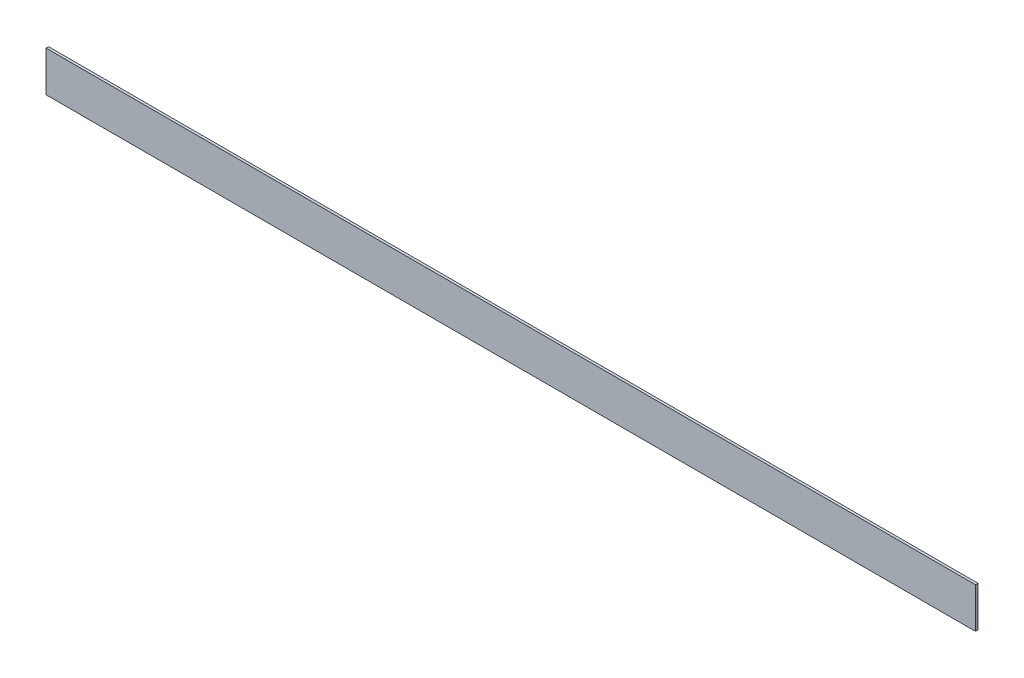
ISO-10303-21;
HEADER;
FILE_DESCRIPTION(('STEP AP214'),'2;1');
FILE_NAME('part.step','',(''),(''),'','','');
FILE_SCHEMA(('AUTOMOTIVE_DESIGN { 1 0 10303 214 1 1 1 1 }'));
ENDSEC;
DATA;
#1=APPLICATION_CONTEXT('core data for automotive mechanical design processes');
#2=APPLICATION_PROTOCOL_DEFINITION('international standard','automotive_design',2000,#1);
#3=PRODUCT_CONTEXT('',#1,'mechanical');
#4=PRODUCT('Part','Part','',(#3));
#5=PRODUCT_RELATED_PRODUCT_CATEGORY('part','',(#4));
#6=PRODUCT_DEFINITION_FORMATION('','',#4);
#7=PRODUCT_DEFINITION_CONTEXT('part definition',#1,'design');
#8=PRODUCT_DEFINITION('design','',#6,#7);
#9=PRODUCT_DEFINITION_SHAPE('','',#8);
#10=(LENGTH_UNIT() NAMED_UNIT(*) SI_UNIT(.MILLI.,.METRE.));
#11=(NAMED_UNIT(*) PLANE_ANGLE_UNIT() SI_UNIT($,.RADIAN.));
#12=(NAMED_UNIT(*) SI_UNIT($,.STERADIAN.) SOLID_ANGLE_UNIT());
#13=UNCERTAINTY_MEASURE_WITH_UNIT(LENGTH_MEASURE(1.E-05),#10,'distance_accuracy_value','');
#14=(GEOMETRIC_REPRESENTATION_CONTEXT(3) GLOBAL_UNCERTAINTY_ASSIGNED_CONTEXT((#13)) GLOBAL_UNIT_ASSIGNED_CONTEXT((#10,
#11,#12)) REPRESENTATION_CONTEXT('',''));
#15=CARTESIAN_POINT('',(0.,0.,0.));
#16=DIRECTION('',(0.,0.,1.));
#17=DIRECTION('',(1.,0.,0.));
#18=AXIS2_PLACEMENT_3D('',#15,#16,#17);
#19=CARTESIAN_POINT('',(292.1,12.7,1.5875));
#20=DIRECTION('',(-1.,0.,0.));
#21=DIRECTION('',(0.,0.,1.));
#22=AXIS2_PLACEMENT_3D('',#19,#20,#21);
#23=PLANE('',#22);
#24=DIRECTION('',(0.,1.,0.));
#25=VECTOR('',#24,1.);
#26=CARTESIAN_POINT('',(292.1,12.7,0.));
#27=LINE('',#26,#25);
#28=CARTESIAN_POINT('',(292.1,-12.7,0.));
#29=VERTEX_POINT('',#28);
#30=CARTESIAN_POINT('',(292.1,12.7,0.));
#31=VERTEX_POINT('',#30);
#32=EDGE_CURVE('E96',#29,#31,#27,.T.);
#33=ORIENTED_EDGE('',*,*,#32,.T.);
#34=DIRECTION('',(0.,0.,-1.));
#35=VECTOR('',#34,1.);
#36=CARTESIAN_POINT('',(292.1,12.7,1.5875));
#37=LINE('',#36,#35);
#38=CARTESIAN_POINT('',(292.1,12.7,1.5875));
#39=VERTEX_POINT('',#38);
#40=EDGE_CURVE('E11',#39,#31,#37,.T.);
#41=ORIENTED_EDGE('',*,*,#40,.F.);
#42=DIRECTION('',(0.,1.,0.));
#43=VECTOR('',#42,1.);
#44=CARTESIAN_POINT('',(292.1,12.7,1.5875));
#45=LINE('',#44,#43);
#46=CARTESIAN_POINT('',(292.1,-12.7,1.5875));
#47=VERTEX_POINT('',#46);
#48=EDGE_CURVE('E84',#47,#39,#45,.T.);
#49=ORIENTED_EDGE('',*,*,#48,.F.);
#50=DIRECTION('',(0.,0.,-1.));
#51=VECTOR('',#50,1.);
#52=CARTESIAN_POINT('',(292.1,-12.7,1.5875));
#53=LINE('',#52,#51);
#54=EDGE_CURVE('E92',#47,#29,#53,.T.);
#55=ORIENTED_EDGE('',*,*,#54,.T.);
#56=EDGE_LOOP('',(#33,#41,#49,#55));
#57=FACE_BOUND('',#56,.T.);
#58=ADVANCED_FACE('F33',(#57),#23,.F.);
#59=CARTESIAN_POINT('',(-292.1,12.7,1.5875));
#60=DIRECTION('',(0.,-1.,0.));
#61=DIRECTION('',(0.,0.,-1.));
#62=AXIS2_PLACEMENT_3D('',#59,#60,#61);
#63=PLANE('',#62);
#64=DIRECTION('',(-1.,0.,0.));
#65=VECTOR('',#64,1.);
#66=CARTESIAN_POINT('',(-292.1,12.7,0.));
#67=LINE('',#66,#65);
#68=CARTESIAN_POINT('',(-292.1,12.7,0.));
#69=VERTEX_POINT('',#68);
#70=EDGE_CURVE('E88',#31,#69,#67,.T.);
#71=ORIENTED_EDGE('',*,*,#70,.T.);
#72=DIRECTION('',(0.,0.,-1.));
#73=VECTOR('',#72,1.);
#74=CARTESIAN_POINT('',(-292.1,12.7,1.5875));
#75=LINE('',#74,#73);
#76=CARTESIAN_POINT('',(-292.1,12.7,1.5875));
#77=VERTEX_POINT('',#76);
#78=EDGE_CURVE('E41',#77,#69,#75,.T.);
#79=ORIENTED_EDGE('',*,*,#78,.F.);
#80=DIRECTION('',(-1.,0.,0.));
#81=VECTOR('',#80,1.);
#82=CARTESIAN_POINT('',(-292.1,12.7,1.5875));
#83=LINE('',#82,#81);
#84=EDGE_CURVE('E79',#39,#77,#83,.T.);
#85=ORIENTED_EDGE('',*,*,#84,.F.);
#86=ORIENTED_EDGE('',*,*,#40,.T.);
#87=EDGE_LOOP('',(#71,#79,#85,#86));
#88=FACE_BOUND('',#87,.T.);
#89=ADVANCED_FACE('F87',(#88),#63,.F.);
#90=CARTESIAN_POINT('',(-292.1,12.7,1.5875));
#91=DIRECTION('',(1.,0.,0.));
#92=DIRECTION('',(0.,0.,-1.));
#93=AXIS2_PLACEMENT_3D('',#90,#91,#92);
#94=PLANE('',#93);
#95=DIRECTION('',(0.,-1.,0.));
#96=VECTOR('',#95,1.);
#97=CARTESIAN_POINT('',(-292.1,12.7,0.));
#98=LINE('',#97,#96);
#99=CARTESIAN_POINT('',(-292.1,-12.7,0.));
#100=VERTEX_POINT('',#99);
#101=EDGE_CURVE('E66',#69,#100,#98,.T.);
#102=ORIENTED_EDGE('',*,*,#101,.T.);
#103=DIRECTION('',(0.,0.,-1.));
#104=VECTOR('',#103,1.);
#105=CARTESIAN_POINT('',(-292.1,-12.7,1.5875));
#106=LINE('',#105,#104);
#107=CARTESIAN_POINT('',(-292.1,-12.7,1.5875));
#108=VERTEX_POINT('',#107);
#109=EDGE_CURVE('E89',#108,#100,#106,.T.);
#110=ORIENTED_EDGE('',*,*,#109,.F.);
#111=DIRECTION('',(0.,-1.,0.));
#112=VECTOR('',#111,1.);
#113=CARTESIAN_POINT('',(-292.1,12.7,1.5875));
#114=LINE('',#113,#112);
#115=EDGE_CURVE('E82',#77,#108,#114,.T.);
#116=ORIENTED_EDGE('',*,*,#115,.F.);
#117=ORIENTED_EDGE('',*,*,#78,.T.);
#118=EDGE_LOOP('',(#102,#110,#116,#117));
#119=FACE_BOUND('',#118,.T.);
#120=ADVANCED_FACE('F90',(#119),#94,.F.);
#121=CARTESIAN_POINT('',(-292.1,-12.7,1.5875));
#122=DIRECTION('',(0.,1.,0.));
#123=DIRECTION('',(0.,0.,1.));
#124=AXIS2_PLACEMENT_3D('',#121,#122,#123);
#125=PLANE('',#124);
#126=DIRECTION('',(1.,0.,0.));
#127=VECTOR('',#126,1.);
#128=CARTESIAN_POINT('',(-292.1,-12.7,0.));
#129=LINE('',#128,#127);
#130=EDGE_CURVE('E72',#100,#29,#129,.T.);
#131=ORIENTED_EDGE('',*,*,#130,.T.);
#132=ORIENTED_EDGE('',*,*,#54,.F.);
#133=DIRECTION('',(1.,0.,0.));
#134=VECTOR('',#133,1.);
#135=CARTESIAN_POINT('',(-292.1,-12.7,1.5875));
#136=LINE('',#135,#134);
#137=EDGE_CURVE('E49',#108,#47,#136,.T.);
#138=ORIENTED_EDGE('',*,*,#137,.F.);
#139=ORIENTED_EDGE('',*,*,#109,.T.);
#140=EDGE_LOOP('',(#131,#132,#138,#139));
#141=FACE_BOUND('',#140,.T.);
#142=ADVANCED_FACE('F103',(#141),#125,.F.);
#143=CARTESIAN_POINT('',(0.,0.,1.5875));
#144=DIRECTION('',(0.,0.,1.));
#145=DIRECTION('',(1.,0.,0.));
#146=AXIS2_PLACEMENT_3D('',#143,#144,#145);
#147=PLANE('',#146);
#148=ORIENTED_EDGE('',*,*,#48,.T.);
#149=ORIENTED_EDGE('',*,*,#84,.T.);
#150=ORIENTED_EDGE('',*,*,#115,.T.);
#151=ORIENTED_EDGE('',*,*,#137,.T.);
#152=EDGE_LOOP('',(#148,#149,#150,#151));
#153=FACE_BOUND('',#152,.T.);
#154=ADVANCED_FACE('F80',(#153),#147,.T.);
#155=CARTESIAN_POINT('',(0.,0.,0.));
#156=DIRECTION('',(0.,0.,1.));
#157=DIRECTION('',(1.,0.,0.));
#158=AXIS2_PLACEMENT_3D('',#155,#156,#157);
#159=PLANE('',#158);
#160=ORIENTED_EDGE('',*,*,#32,.F.);
#161=ORIENTED_EDGE('',*,*,#130,.F.);
#162=ORIENTED_EDGE('',*,*,#101,.F.);
#163=ORIENTED_EDGE('',*,*,#70,.F.);
#164=EDGE_LOOP('',(#160,#161,#162,#163));
#165=FACE_BOUND('',#164,.T.);
#166=ADVANCED_FACE('F106',(#165),#159,.F.);
#167=CLOSED_SHELL('',(#58,#89,#120,#142,#154,#166));
#168=MANIFOLD_SOLID_BREP('B2',#167);
#169=ADVANCED_BREP_SHAPE_REPRESENTATION('',(#18,#168),#14);
#170=SHAPE_DEFINITION_REPRESENTATION(#9,#169);
ENDSEC;
END-ISO-10303-21;
